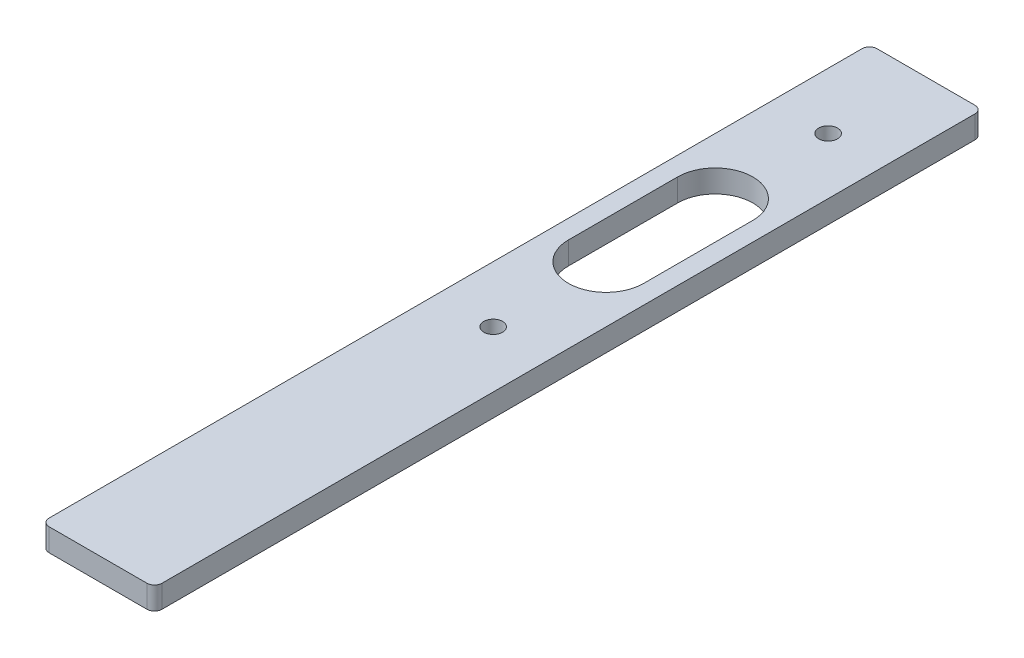
ISO-10303-21;
HEADER;
FILE_DESCRIPTION(('STEP AP214'),'2;1');
FILE_NAME('part.step','',(''),(''),'','','');
FILE_SCHEMA(('AUTOMOTIVE_DESIGN { 1 0 10303 214 1 1 1 1 }'));
ENDSEC;
DATA;
#1=APPLICATION_CONTEXT('core data for automotive mechanical design processes');
#2=APPLICATION_PROTOCOL_DEFINITION('international standard','automotive_design',2000,#1);
#3=PRODUCT_CONTEXT('',#1,'mechanical');
#4=PRODUCT('Part','Part','',(#3));
#5=PRODUCT_RELATED_PRODUCT_CATEGORY('part','',(#4));
#6=PRODUCT_DEFINITION_FORMATION('','',#4);
#7=PRODUCT_DEFINITION_CONTEXT('part definition',#1,'design');
#8=PRODUCT_DEFINITION('design','',#6,#7);
#9=PRODUCT_DEFINITION_SHAPE('','',#8);
#10=(LENGTH_UNIT() NAMED_UNIT(*) SI_UNIT(.MILLI.,.METRE.));
#11=(NAMED_UNIT(*) PLANE_ANGLE_UNIT() SI_UNIT($,.RADIAN.));
#12=(NAMED_UNIT(*) SI_UNIT($,.STERADIAN.) SOLID_ANGLE_UNIT());
#13=UNCERTAINTY_MEASURE_WITH_UNIT(LENGTH_MEASURE(1.E-05),#10,'distance_accuracy_value','');
#14=(GEOMETRIC_REPRESENTATION_CONTEXT(3) GLOBAL_UNCERTAINTY_ASSIGNED_CONTEXT((#13)) GLOBAL_UNIT_ASSIGNED_CONTEXT((#10,
#11,#12)) REPRESENTATION_CONTEXT('',''));
#15=CARTESIAN_POINT('',(0.,0.,0.));
#16=DIRECTION('',(0.,0.,1.));
#17=DIRECTION('',(1.,0.,0.));
#18=AXIS2_PLACEMENT_3D('',#15,#16,#17);
#19=CARTESIAN_POINT('',(0.,3.,0.));
#20=DIRECTION('',(1.,0.,0.));
#21=DIRECTION('',(0.,0.,1.));
#22=AXIS2_PLACEMENT_3D('',#19,#20,#21);
#23=PLANE('',#22);
#24=DIRECTION('',(0.,0.,-1.));
#25=VECTOR('',#24,1.);
#26=CARTESIAN_POINT('',(0.,3.,0.));
#27=LINE('',#26,#25);
#28=CARTESIAN_POINT('',(0.,3.,109.));
#29=VERTEX_POINT('',#28);
#30=CARTESIAN_POINT('',(0.,3.,1.));
#31=VERTEX_POINT('',#30);
#32=EDGE_CURVE('E167',#29,#31,#27,.T.);
#33=ORIENTED_EDGE('',*,*,#32,.T.);
#34=DIRECTION('',(0.,-1.,0.));
#35=VECTOR('',#34,1.);
#36=CARTESIAN_POINT('',(0.,3.,1.));
#37=LINE('',#36,#35);
#38=CARTESIAN_POINT('',(0.,0.,1.));
#39=VERTEX_POINT('',#38);
#40=EDGE_CURVE('E218',#39,#31,#37,.F.);
#41=ORIENTED_EDGE('',*,*,#40,.F.);
#42=DIRECTION('',(0.,0.,-1.));
#43=VECTOR('',#42,1.);
#44=CARTESIAN_POINT('',(0.,0.,0.));
#45=LINE('',#44,#43);
#46=CARTESIAN_POINT('',(0.,0.,109.));
#47=VERTEX_POINT('',#46);
#48=EDGE_CURVE('E158',#47,#39,#45,.T.);
#49=ORIENTED_EDGE('',*,*,#48,.F.);
#50=DIRECTION('',(0.,-1.,0.));
#51=VECTOR('',#50,1.);
#52=CARTESIAN_POINT('',(0.,3.,109.));
#53=LINE('',#52,#51);
#54=EDGE_CURVE('E221',#29,#47,#53,.T.);
#55=ORIENTED_EDGE('',*,*,#54,.F.);
#56=EDGE_LOOP('',(#33,#41,#49,#55));
#57=FACE_BOUND('',#56,.T.);
#58=ADVANCED_FACE('F37',(#57),#23,.F.);
#59=CARTESIAN_POINT('',(0.,3.,0.));
#60=DIRECTION('',(0.,0.,1.));
#61=DIRECTION('',(-1.,0.,0.));
#62=AXIS2_PLACEMENT_3D('',#59,#60,#61);
#63=PLANE('',#62);
#64=DIRECTION('',(1.,0.,0.));
#65=VECTOR('',#64,1.);
#66=CARTESIAN_POINT('',(0.,0.,0.));
#67=LINE('',#66,#65);
#68=CARTESIAN_POINT('',(1.,0.,0.));
#69=VERTEX_POINT('',#68);
#70=CARTESIAN_POINT('',(14.,0.,0.));
#71=VERTEX_POINT('',#70);
#72=EDGE_CURVE('E183',#69,#71,#67,.T.);
#73=ORIENTED_EDGE('',*,*,#72,.F.);
#74=DIRECTION('',(0.,-1.,0.));
#75=VECTOR('',#74,1.);
#76=CARTESIAN_POINT('',(1.,3.,0.));
#77=LINE('',#76,#75);
#78=CARTESIAN_POINT('',(1.,3.,0.));
#79=VERTEX_POINT('',#78);
#80=EDGE_CURVE('E224',#79,#69,#77,.T.);
#81=ORIENTED_EDGE('',*,*,#80,.F.);
#82=DIRECTION('',(1.,0.,0.));
#83=VECTOR('',#82,1.);
#84=CARTESIAN_POINT('',(0.,3.,0.));
#85=LINE('',#84,#83);
#86=CARTESIAN_POINT('',(14.,3.,0.));
#87=VERTEX_POINT('',#86);
#88=EDGE_CURVE('E170',#79,#87,#85,.T.);
#89=ORIENTED_EDGE('',*,*,#88,.T.);
#90=DIRECTION('',(0.,-1.,0.));
#91=VECTOR('',#90,1.);
#92=CARTESIAN_POINT('',(14.,3.,0.));
#93=LINE('',#92,#91);
#94=EDGE_CURVE('E227',#71,#87,#93,.F.);
#95=ORIENTED_EDGE('',*,*,#94,.F.);
#96=EDGE_LOOP('',(#73,#81,#89,#95));
#97=FACE_BOUND('',#96,.T.);
#98=ADVANCED_FACE('F253',(#97),#63,.F.);
#99=CARTESIAN_POINT('',(15.,3.,0.));
#100=DIRECTION('',(-1.,0.,0.));
#101=DIRECTION('',(0.,0.,-1.));
#102=AXIS2_PLACEMENT_3D('',#99,#100,#101);
#103=PLANE('',#102);
#104=DIRECTION('',(0.,0.,1.));
#105=VECTOR('',#104,1.);
#106=CARTESIAN_POINT('',(15.,0.,0.));
#107=LINE('',#106,#105);
#108=CARTESIAN_POINT('',(15.,0.,1.));
#109=VERTEX_POINT('',#108);
#110=CARTESIAN_POINT('',(15.,0.,109.));
#111=VERTEX_POINT('',#110);
#112=EDGE_CURVE('E186',#109,#111,#107,.T.);
#113=ORIENTED_EDGE('',*,*,#112,.F.);
#114=DIRECTION('',(0.,-1.,0.));
#115=VECTOR('',#114,1.);
#116=CARTESIAN_POINT('',(15.,3.,1.));
#117=LINE('',#116,#115);
#118=CARTESIAN_POINT('',(15.,3.,1.));
#119=VERTEX_POINT('',#118);
#120=EDGE_CURVE('E204',#119,#109,#117,.T.);
#121=ORIENTED_EDGE('',*,*,#120,.F.);
#122=DIRECTION('',(0.,0.,1.));
#123=VECTOR('',#122,1.);
#124=CARTESIAN_POINT('',(15.,3.,0.));
#125=LINE('',#124,#123);
#126=CARTESIAN_POINT('',(15.,3.,109.));
#127=VERTEX_POINT('',#126);
#128=EDGE_CURVE('E174',#119,#127,#125,.T.);
#129=ORIENTED_EDGE('',*,*,#128,.T.);
#130=DIRECTION('',(0.,-1.,0.));
#131=VECTOR('',#130,1.);
#132=CARTESIAN_POINT('',(15.,3.,109.));
#133=LINE('',#132,#131);
#134=EDGE_CURVE('E207',#111,#127,#133,.F.);
#135=ORIENTED_EDGE('',*,*,#134,.F.);
#136=EDGE_LOOP('',(#113,#121,#129,#135));
#137=FACE_BOUND('',#136,.T.);
#138=ADVANCED_FACE('F259',(#137),#103,.F.);
#139=CARTESIAN_POINT('',(0.,3.,110.));
#140=DIRECTION('',(0.,0.,-1.));
#141=DIRECTION('',(1.,0.,0.));
#142=AXIS2_PLACEMENT_3D('',#139,#140,#141);
#143=PLANE('',#142);
#144=DIRECTION('',(-1.,0.,0.));
#145=VECTOR('',#144,1.);
#146=CARTESIAN_POINT('',(0.,3.,110.));
#147=LINE('',#146,#145);
#148=CARTESIAN_POINT('',(14.,3.,110.));
#149=VERTEX_POINT('',#148);
#150=CARTESIAN_POINT('',(1.,3.,110.));
#151=VERTEX_POINT('',#150);
#152=EDGE_CURVE('E177',#149,#151,#147,.T.);
#153=ORIENTED_EDGE('',*,*,#152,.T.);
#154=DIRECTION('',(0.,-1.,0.));
#155=VECTOR('',#154,1.);
#156=CARTESIAN_POINT('',(1.,3.,110.));
#157=LINE('',#156,#155);
#158=CARTESIAN_POINT('',(1.,0.,110.));
#159=VERTEX_POINT('',#158);
#160=EDGE_CURVE('E180',#159,#151,#157,.F.);
#161=ORIENTED_EDGE('',*,*,#160,.F.);
#162=DIRECTION('',(-1.,0.,0.));
#163=VECTOR('',#162,1.);
#164=CARTESIAN_POINT('',(0.,0.,110.));
#165=LINE('',#164,#163);
#166=CARTESIAN_POINT('',(14.,0.,110.));
#167=VERTEX_POINT('',#166);
#168=EDGE_CURVE('E171',#167,#159,#165,.T.);
#169=ORIENTED_EDGE('',*,*,#168,.F.);
#170=DIRECTION('',(0.,-1.,0.));
#171=VECTOR('',#170,1.);
#172=CARTESIAN_POINT('',(14.,3.,110.));
#173=LINE('',#172,#171);
#174=EDGE_CURVE('E193',#149,#167,#173,.T.);
#175=ORIENTED_EDGE('',*,*,#174,.F.);
#176=EDGE_LOOP('',(#153,#161,#169,#175));
#177=FACE_BOUND('',#176,.T.);
#178=ADVANCED_FACE('F297',(#177),#143,.F.);
#179=CARTESIAN_POINT('',(0.,3.,0.));
#180=DIRECTION('',(0.,-1.,0.));
#181=DIRECTION('',(0.,0.,1.));
#182=AXIS2_PLACEMENT_3D('',#179,#180,#181);
#183=PLANE('',#182);
#184=DIRECTION('',(0.,0.,-1.));
#185=VECTOR('',#184,1.);
#186=CARTESIAN_POINT('',(2.5,3.,42.5));
#187=LINE('',#186,#185);
#188=CARTESIAN_POINT('',(2.5,3.,42.5));
#189=VERTEX_POINT('',#188);
#190=CARTESIAN_POINT('',(2.50000000000001,3.,28.));
#191=VERTEX_POINT('',#190);
#192=EDGE_CURVE('E129',#189,#191,#187,.T.);
#193=ORIENTED_EDGE('',*,*,#192,.T.);
#194=CARTESIAN_POINT('',(7.5,3.,28.));
#195=DIRECTION('',(0.,-1.,0.));
#196=DIRECTION('',(0.,0.,-1.));
#197=AXIS2_PLACEMENT_3D('',#194,#195,#196);
#198=CIRCLE('',#197,5.);
#199=CARTESIAN_POINT('',(12.5,3.,28.));
#200=VERTEX_POINT('',#199);
#201=EDGE_CURVE('E136',#191,#200,#198,.T.);
#202=ORIENTED_EDGE('',*,*,#201,.T.);
#203=DIRECTION('',(0.,0.,1.));
#204=VECTOR('',#203,1.);
#205=CARTESIAN_POINT('',(12.5,3.,42.5));
#206=LINE('',#205,#204);
#207=CARTESIAN_POINT('',(12.5,3.,42.5));
#208=VERTEX_POINT('',#207);
#209=EDGE_CURVE('E141',#200,#208,#206,.T.);
#210=ORIENTED_EDGE('',*,*,#209,.T.);
#211=CARTESIAN_POINT('',(7.5,3.,42.5));
#212=DIRECTION('',(0.,-1.,0.));
#213=DIRECTION('',(0.,0.,-1.));
#214=AXIS2_PLACEMENT_3D('',#211,#212,#213);
#215=CIRCLE('',#214,5.);
#216=EDGE_CURVE('E145',#208,#189,#215,.T.);
#217=ORIENTED_EDGE('',*,*,#216,.T.);
#218=EDGE_LOOP('',(#193,#202,#210,#217));
#219=FACE_BOUND('',#218,.T.);
#220=CARTESIAN_POINT('',(7.5,3.,13.));
#221=DIRECTION('',(0.,-1.,0.));
#222=DIRECTION('',(0.,0.,-1.));
#223=AXIS2_PLACEMENT_3D('',#220,#221,#222);
#224=CIRCLE('',#223,1.25);
#225=CARTESIAN_POINT('',(7.5,3.,11.75));
#226=VERTEX_POINT('',#225);
#227=EDGE_CURVE('E159',#226,#226,#224,.T.);
#228=ORIENTED_EDGE('',*,*,#227,.T.);
#229=EDGE_LOOP('',(#228));
#230=FACE_BOUND('',#229,.T.);
#231=CARTESIAN_POINT('',(7.5,3.,57.5));
#232=DIRECTION('',(0.,-1.,0.));
#233=DIRECTION('',(0.,0.,-1.));
#234=AXIS2_PLACEMENT_3D('',#231,#232,#233);
#235=CIRCLE('',#234,1.25);
#236=CARTESIAN_POINT('',(7.5,3.,56.25));
#237=VERTEX_POINT('',#236);
#238=EDGE_CURVE('E152',#237,#237,#235,.T.);
#239=ORIENTED_EDGE('',*,*,#238,.T.);
#240=EDGE_LOOP('',(#239));
#241=FACE_BOUND('',#240,.T.);
#242=ORIENTED_EDGE('',*,*,#128,.F.);
#243=CARTESIAN_POINT('',(14.,3.,1.));
#244=DIRECTION('',(0.,1.,0.));
#245=DIRECTION('',(0.,0.,1.));
#246=AXIS2_PLACEMENT_3D('',#243,#244,#245);
#247=CIRCLE('',#246,1.);
#248=EDGE_CURVE('E212',#87,#119,#247,.F.);
#249=ORIENTED_EDGE('',*,*,#248,.F.);
#250=ORIENTED_EDGE('',*,*,#88,.F.);
#251=CARTESIAN_POINT('',(1.,3.,1.));
#252=DIRECTION('',(0.,1.,0.));
#253=DIRECTION('',(0.,0.,1.));
#254=AXIS2_PLACEMENT_3D('',#251,#252,#253);
#255=CIRCLE('',#254,1.);
#256=EDGE_CURVE('E210',#31,#79,#255,.F.);
#257=ORIENTED_EDGE('',*,*,#256,.F.);
#258=ORIENTED_EDGE('',*,*,#32,.F.);
#259=CARTESIAN_POINT('',(1.,3.,109.));
#260=DIRECTION('',(0.,1.,0.));
#261=DIRECTION('',(0.,0.,1.));
#262=AXIS2_PLACEMENT_3D('',#259,#260,#261);
#263=CIRCLE('',#262,1.);
#264=EDGE_CURVE('E214',#151,#29,#263,.F.);
#265=ORIENTED_EDGE('',*,*,#264,.F.);
#266=ORIENTED_EDGE('',*,*,#152,.F.);
#267=CARTESIAN_POINT('',(14.,3.,109.));
#268=DIRECTION('',(0.,1.,0.));
#269=DIRECTION('',(0.,0.,1.));
#270=AXIS2_PLACEMENT_3D('',#267,#268,#269);
#271=CIRCLE('',#270,1.);
#272=EDGE_CURVE('E216',#127,#149,#271,.F.);
#273=ORIENTED_EDGE('',*,*,#272,.F.);
#274=EDGE_LOOP('',(#242,#249,#250,#257,#258,#265,#266,#273));
#275=FACE_BOUND('',#274,.T.);
#276=ADVANCED_FACE('F143',(#219,#230,#241,#275),#183,.F.);
#277=CARTESIAN_POINT('',(0.,0.,0.));
#278=DIRECTION('',(0.,-1.,0.));
#279=DIRECTION('',(0.,0.,1.));
#280=AXIS2_PLACEMENT_3D('',#277,#278,#279);
#281=PLANE('',#280);
#282=CARTESIAN_POINT('',(7.5,0.,42.5));
#283=DIRECTION('',(0.,1.,0.));
#284=DIRECTION('',(0.,0.,1.));
#285=AXIS2_PLACEMENT_3D('',#282,#283,#284);
#286=CIRCLE('',#285,5.);
#287=CARTESIAN_POINT('',(2.5,0.,42.5));
#288=VERTEX_POINT('',#287);
#289=CARTESIAN_POINT('',(12.5,0.,42.5));
#290=VERTEX_POINT('',#289);
#291=EDGE_CURVE('E11',#288,#290,#286,.T.);
#292=ORIENTED_EDGE('',*,*,#291,.T.);
#293=DIRECTION('',(0.,0.,-1.));
#294=VECTOR('',#293,1.);
#295=CARTESIAN_POINT('',(12.5,0.,0.));
#296=LINE('',#295,#294);
#297=CARTESIAN_POINT('',(12.5,0.,28.));
#298=VERTEX_POINT('',#297);
#299=EDGE_CURVE('E45',#290,#298,#296,.T.);
#300=ORIENTED_EDGE('',*,*,#299,.T.);
#301=CARTESIAN_POINT('',(7.5,0.,28.));
#302=DIRECTION('',(0.,1.,0.));
#303=DIRECTION('',(0.,0.,1.));
#304=AXIS2_PLACEMENT_3D('',#301,#302,#303);
#305=CIRCLE('',#304,5.);
#306=CARTESIAN_POINT('',(2.50000000000001,0.,28.));
#307=VERTEX_POINT('',#306);
#308=EDGE_CURVE('E231',#298,#307,#305,.T.);
#309=ORIENTED_EDGE('',*,*,#308,.T.);
#310=DIRECTION('',(0.,0.,1.));
#311=VECTOR('',#310,1.);
#312=CARTESIAN_POINT('',(2.50000000000001,0.,0.));
#313=LINE('',#312,#311);
#314=EDGE_CURVE('E131',#307,#288,#313,.T.);
#315=ORIENTED_EDGE('',*,*,#314,.T.);
#316=EDGE_LOOP('',(#292,#300,#309,#315));
#317=FACE_BOUND('',#316,.T.);
#318=CARTESIAN_POINT('',(7.5,0.,13.));
#319=DIRECTION('',(0.,-1.,0.));
#320=DIRECTION('',(0.,0.,-1.));
#321=AXIS2_PLACEMENT_3D('',#318,#319,#320);
#322=CIRCLE('',#321,1.25);
#323=CARTESIAN_POINT('',(7.5,0.,11.75));
#324=VERTEX_POINT('',#323);
#325=EDGE_CURVE('E155',#324,#324,#322,.T.);
#326=ORIENTED_EDGE('',*,*,#325,.F.);
#327=EDGE_LOOP('',(#326));
#328=FACE_BOUND('',#327,.T.);
#329=CARTESIAN_POINT('',(7.5,0.,57.5));
#330=DIRECTION('',(0.,-1.,0.));
#331=DIRECTION('',(0.,0.,-1.));
#332=AXIS2_PLACEMENT_3D('',#329,#330,#331);
#333=CIRCLE('',#332,1.25);
#334=CARTESIAN_POINT('',(7.5,0.,56.25));
#335=VERTEX_POINT('',#334);
#336=EDGE_CURVE('E162',#335,#335,#333,.T.);
#337=ORIENTED_EDGE('',*,*,#336,.F.);
#338=EDGE_LOOP('',(#337));
#339=FACE_BOUND('',#338,.T.);
#340=ORIENTED_EDGE('',*,*,#168,.T.);
#341=CARTESIAN_POINT('',(1.,0.,109.));
#342=DIRECTION('',(0.,1.,0.));
#343=DIRECTION('',(0.,0.,1.));
#344=AXIS2_PLACEMENT_3D('',#341,#342,#343);
#345=CIRCLE('',#344,1.);
#346=EDGE_CURVE('E200',#47,#159,#345,.T.);
#347=ORIENTED_EDGE('',*,*,#346,.F.);
#348=ORIENTED_EDGE('',*,*,#48,.T.);
#349=CARTESIAN_POINT('',(1.,0.,1.));
#350=DIRECTION('',(0.,1.,0.));
#351=DIRECTION('',(0.,0.,1.));
#352=AXIS2_PLACEMENT_3D('',#349,#350,#351);
#353=CIRCLE('',#352,1.);
#354=EDGE_CURVE('E196',#69,#39,#353,.T.);
#355=ORIENTED_EDGE('',*,*,#354,.F.);
#356=ORIENTED_EDGE('',*,*,#72,.T.);
#357=CARTESIAN_POINT('',(14.,0.,1.));
#358=DIRECTION('',(0.,1.,0.));
#359=DIRECTION('',(0.,0.,1.));
#360=AXIS2_PLACEMENT_3D('',#357,#358,#359);
#361=CIRCLE('',#360,1.);
#362=EDGE_CURVE('E198',#109,#71,#361,.T.);
#363=ORIENTED_EDGE('',*,*,#362,.F.);
#364=ORIENTED_EDGE('',*,*,#112,.T.);
#365=CARTESIAN_POINT('',(14.,0.,109.));
#366=DIRECTION('',(0.,1.,0.));
#367=DIRECTION('',(0.,0.,1.));
#368=AXIS2_PLACEMENT_3D('',#365,#366,#367);
#369=CIRCLE('',#368,1.);
#370=EDGE_CURVE('E202',#167,#111,#369,.T.);
#371=ORIENTED_EDGE('',*,*,#370,.F.);
#372=EDGE_LOOP('',(#340,#347,#348,#355,#356,#363,#364,#371));
#373=FACE_BOUND('',#372,.T.);
#374=ADVANCED_FACE('F235',(#317,#328,#339,#373),#281,.T.);
#375=CARTESIAN_POINT('',(14.,3.,109.));
#376=DIRECTION('',(0.,-1.,0.));
#377=DIRECTION('',(0.,0.,1.));
#378=AXIS2_PLACEMENT_3D('',#375,#376,#377);
#379=CYLINDRICAL_SURFACE('',#378,1.);
#380=ORIENTED_EDGE('',*,*,#272,.T.);
#381=ORIENTED_EDGE('',*,*,#174,.T.);
#382=ORIENTED_EDGE('',*,*,#370,.T.);
#383=ORIENTED_EDGE('',*,*,#134,.T.);
#384=EDGE_LOOP('',(#380,#381,#382,#383));
#385=FACE_BOUND('',#384,.T.);
#386=ADVANCED_FACE('F264',(#385),#379,.T.);
#387=CARTESIAN_POINT('',(1.,3.,109.));
#388=DIRECTION('',(0.,-1.,0.));
#389=DIRECTION('',(0.,0.,1.));
#390=AXIS2_PLACEMENT_3D('',#387,#388,#389);
#391=CYLINDRICAL_SURFACE('',#390,1.);
#392=ORIENTED_EDGE('',*,*,#264,.T.);
#393=ORIENTED_EDGE('',*,*,#54,.T.);
#394=ORIENTED_EDGE('',*,*,#346,.T.);
#395=ORIENTED_EDGE('',*,*,#160,.T.);
#396=EDGE_LOOP('',(#392,#393,#394,#395));
#397=FACE_BOUND('',#396,.T.);
#398=ADVANCED_FACE('F267',(#397),#391,.T.);
#399=CARTESIAN_POINT('',(14.,3.,1.));
#400=DIRECTION('',(0.,-1.,0.));
#401=DIRECTION('',(0.,0.,1.));
#402=AXIS2_PLACEMENT_3D('',#399,#400,#401);
#403=CYLINDRICAL_SURFACE('',#402,1.);
#404=ORIENTED_EDGE('',*,*,#248,.T.);
#405=ORIENTED_EDGE('',*,*,#120,.T.);
#406=ORIENTED_EDGE('',*,*,#362,.T.);
#407=ORIENTED_EDGE('',*,*,#94,.T.);
#408=EDGE_LOOP('',(#404,#405,#406,#407));
#409=FACE_BOUND('',#408,.T.);
#410=ADVANCED_FACE('F270',(#409),#403,.T.);
#411=CARTESIAN_POINT('',(1.,3.,1.));
#412=DIRECTION('',(0.,-1.,0.));
#413=DIRECTION('',(0.,0.,1.));
#414=AXIS2_PLACEMENT_3D('',#411,#412,#413);
#415=CYLINDRICAL_SURFACE('',#414,1.);
#416=ORIENTED_EDGE('',*,*,#256,.T.);
#417=ORIENTED_EDGE('',*,*,#80,.T.);
#418=ORIENTED_EDGE('',*,*,#354,.T.);
#419=ORIENTED_EDGE('',*,*,#40,.T.);
#420=EDGE_LOOP('',(#416,#417,#418,#419));
#421=FACE_BOUND('',#420,.T.);
#422=ADVANCED_FACE('F39',(#421),#415,.T.);
#423=CARTESIAN_POINT('',(7.5,0.,57.5));
#424=DIRECTION('',(0.,1.,0.));
#425=DIRECTION('',(0.,0.,-1.));
#426=AXIS2_PLACEMENT_3D('',#423,#424,#425);
#427=CYLINDRICAL_SURFACE('',#426,1.25);
#428=ORIENTED_EDGE('',*,*,#336,.T.);
#429=EDGE_LOOP('',(#428));
#430=FACE_BOUND('',#429,.T.);
#431=ORIENTED_EDGE('',*,*,#238,.F.);
#432=EDGE_LOOP('',(#431));
#433=FACE_BOUND('',#432,.T.);
#434=ADVANCED_FACE('F248',(#430,#433),#427,.F.);
#435=CARTESIAN_POINT('',(7.5,0.,13.));
#436=DIRECTION('',(0.,1.,0.));
#437=DIRECTION('',(0.,0.,-1.));
#438=AXIS2_PLACEMENT_3D('',#435,#436,#437);
#439=CYLINDRICAL_SURFACE('',#438,1.25);
#440=ORIENTED_EDGE('',*,*,#325,.T.);
#441=EDGE_LOOP('',(#440));
#442=FACE_BOUND('',#441,.T.);
#443=ORIENTED_EDGE('',*,*,#227,.F.);
#444=EDGE_LOOP('',(#443));
#445=FACE_BOUND('',#444,.T.);
#446=ADVANCED_FACE('F241',(#442,#445),#439,.F.);
#447=CARTESIAN_POINT('',(7.5,-7.,42.5));
#448=DIRECTION('',(0.,1.,0.));
#449=DIRECTION('',(0.,0.,-1.));
#450=AXIS2_PLACEMENT_3D('',#447,#448,#449);
#451=CYLINDRICAL_SURFACE('',#450,5.);
#452=ORIENTED_EDGE('',*,*,#291,.F.);
#453=DIRECTION('',(0.,1.,0.));
#454=VECTOR('',#453,1.);
#455=CARTESIAN_POINT('',(2.5,-7.,42.5));
#456=LINE('',#455,#454);
#457=EDGE_CURVE('E52',#288,#189,#456,.T.);
#458=ORIENTED_EDGE('',*,*,#457,.T.);
#459=ORIENTED_EDGE('',*,*,#216,.F.);
#460=DIRECTION('',(0.,1.,0.));
#461=VECTOR('',#460,1.);
#462=CARTESIAN_POINT('',(12.5,-7.,42.5));
#463=LINE('',#462,#461);
#464=EDGE_CURVE('E150',#290,#208,#463,.T.);
#465=ORIENTED_EDGE('',*,*,#464,.F.);
#466=EDGE_LOOP('',(#452,#458,#459,#465));
#467=FACE_BOUND('',#466,.T.);
#468=ADVANCED_FACE('F239',(#467),#451,.F.);
#469=CARTESIAN_POINT('',(12.5,-7.,42.5));
#470=DIRECTION('',(1.,0.,0.));
#471=DIRECTION('',(0.,0.,1.));
#472=AXIS2_PLACEMENT_3D('',#469,#470,#471);
#473=PLANE('',#472);
#474=ORIENTED_EDGE('',*,*,#299,.F.);
#475=ORIENTED_EDGE('',*,*,#464,.T.);
#476=ORIENTED_EDGE('',*,*,#209,.F.);
#477=DIRECTION('',(0.,1.,0.));
#478=VECTOR('',#477,1.);
#479=CARTESIAN_POINT('',(12.5,-7.,28.));
#480=LINE('',#479,#478);
#481=EDGE_CURVE('E133',#298,#200,#480,.T.);
#482=ORIENTED_EDGE('',*,*,#481,.F.);
#483=EDGE_LOOP('',(#474,#475,#476,#482));
#484=FACE_BOUND('',#483,.T.);
#485=ADVANCED_FACE('F238',(#484),#473,.F.);
#486=CARTESIAN_POINT('',(7.5,-7.,28.));
#487=DIRECTION('',(0.,1.,0.));
#488=DIRECTION('',(0.,0.,-1.));
#489=AXIS2_PLACEMENT_3D('',#486,#487,#488);
#490=CYLINDRICAL_SURFACE('',#489,5.);
#491=ORIENTED_EDGE('',*,*,#308,.F.);
#492=ORIENTED_EDGE('',*,*,#481,.T.);
#493=ORIENTED_EDGE('',*,*,#201,.F.);
#494=DIRECTION('',(0.,1.,0.));
#495=VECTOR('',#494,1.);
#496=CARTESIAN_POINT('',(2.50000000000001,-7.,28.));
#497=LINE('',#496,#495);
#498=EDGE_CURVE('E60',#307,#191,#497,.T.);
#499=ORIENTED_EDGE('',*,*,#498,.F.);
#500=EDGE_LOOP('',(#491,#492,#493,#499));
#501=FACE_BOUND('',#500,.T.);
#502=ADVANCED_FACE('F137',(#501),#490,.F.);
#503=CARTESIAN_POINT('',(2.5,-7.,42.5));
#504=DIRECTION('',(-1.,0.,0.));
#505=DIRECTION('',(0.,0.,-1.));
#506=AXIS2_PLACEMENT_3D('',#503,#504,#505);
#507=PLANE('',#506);
#508=ORIENTED_EDGE('',*,*,#314,.F.);
#509=ORIENTED_EDGE('',*,*,#498,.T.);
#510=ORIENTED_EDGE('',*,*,#192,.F.);
#511=ORIENTED_EDGE('',*,*,#457,.F.);
#512=EDGE_LOOP('',(#508,#509,#510,#511));
#513=FACE_BOUND('',#512,.T.);
#514=ADVANCED_FACE('F127',(#513),#507,.F.);
#515=CLOSED_SHELL('',(#58,#98,#138,#178,#276,#374,#386,#398,#410,#422,#434,#446,#468,#485,#502,#514));
#516=MANIFOLD_SOLID_BREP('B2',#515);
#517=ADVANCED_BREP_SHAPE_REPRESENTATION('',(#18,#516),#14);
#518=SHAPE_DEFINITION_REPRESENTATION(#9,#517);
ENDSEC;
END-ISO-10303-21;
